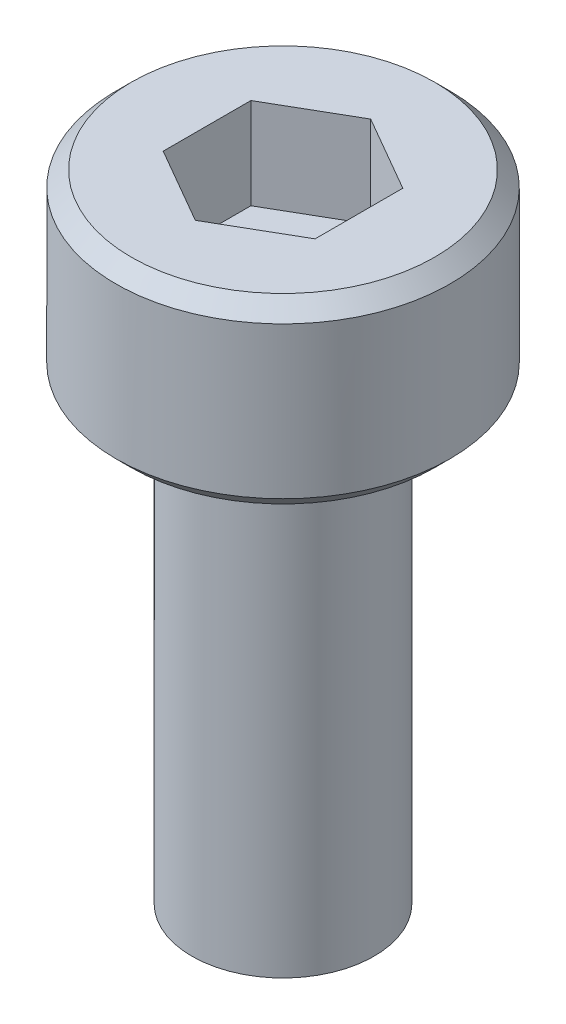
ISO-10303-21;
HEADER;
FILE_DESCRIPTION(('STEP AP214'),'2;1');
FILE_NAME('part.step','',(''),(''),'','','');
FILE_SCHEMA(('AUTOMOTIVE_DESIGN { 1 0 10303 214 1 1 1 1 }'));
ENDSEC;
DATA;
#1=APPLICATION_CONTEXT('core data for automotive mechanical design processes');
#2=APPLICATION_PROTOCOL_DEFINITION('international standard','automotive_design',2000,#1);
#3=PRODUCT_CONTEXT('',#1,'mechanical');
#4=PRODUCT('Part','Part','',(#3));
#5=PRODUCT_RELATED_PRODUCT_CATEGORY('part','',(#4));
#6=PRODUCT_DEFINITION_FORMATION('','',#4);
#7=PRODUCT_DEFINITION_CONTEXT('part definition',#1,'design');
#8=PRODUCT_DEFINITION('design','',#6,#7);
#9=PRODUCT_DEFINITION_SHAPE('','',#8);
#10=(LENGTH_UNIT() NAMED_UNIT(*) SI_UNIT(.MILLI.,.METRE.));
#11=(NAMED_UNIT(*) PLANE_ANGLE_UNIT() SI_UNIT($,.RADIAN.));
#12=(NAMED_UNIT(*) SI_UNIT($,.STERADIAN.) SOLID_ANGLE_UNIT());
#13=UNCERTAINTY_MEASURE_WITH_UNIT(LENGTH_MEASURE(1.E-05),#10,'distance_accuracy_value','');
#14=(GEOMETRIC_REPRESENTATION_CONTEXT(3) GLOBAL_UNCERTAINTY_ASSIGNED_CONTEXT((#13)) GLOBAL_UNIT_ASSIGNED_CONTEXT((#10,
#11,#12)) REPRESENTATION_CONTEXT('',''));
#15=CARTESIAN_POINT('',(0.,0.,0.));
#16=DIRECTION('',(0.,0.,1.));
#17=DIRECTION('',(1.,0.,0.));
#18=AXIS2_PLACEMENT_3D('',#15,#16,#17);
#19=CARTESIAN_POINT('',(-1.25,1.5,0.721687836487032));
#20=DIRECTION('',(0.,-1.,0.));
#21=DIRECTION('',(0.,0.,-1.));
#22=AXIS2_PLACEMENT_3D('',#19,#20,#21);
#23=PLANE('',#22);
#24=DIRECTION('',(0.866025403784439,0.,-0.5));
#25=VECTOR('',#24,1.);
#26=CARTESIAN_POINT('',(0.,1.5,1.44337567297406));
#27=LINE('',#26,#25);
#28=CARTESIAN_POINT('',(0.,1.5,1.44337567297406));
#29=VERTEX_POINT('',#28);
#30=CARTESIAN_POINT('',(1.25,1.5,0.721687836487032));
#31=VERTEX_POINT('',#30);
#32=EDGE_CURVE('E127',#29,#31,#27,.T.);
#33=ORIENTED_EDGE('',*,*,#32,.T.);
#34=DIRECTION('',(0.,0.,-1.));
#35=VECTOR('',#34,1.);
#36=CARTESIAN_POINT('',(1.25,1.5,0.721687836487032));
#37=LINE('',#36,#35);
#38=CARTESIAN_POINT('',(1.25,1.5,-0.721687836487032));
#39=VERTEX_POINT('',#38);
#40=EDGE_CURVE('E132',#31,#39,#37,.T.);
#41=ORIENTED_EDGE('',*,*,#40,.T.);
#42=DIRECTION('',(-0.866025403784439,0.,-0.5));
#43=VECTOR('',#42,1.);
#44=CARTESIAN_POINT('',(1.25,1.5,-0.721687836487032));
#45=LINE('',#44,#43);
#46=CARTESIAN_POINT('',(0.,1.5,-1.44337567297406));
#47=VERTEX_POINT('',#46);
#48=EDGE_CURVE('E136',#39,#47,#45,.T.);
#49=ORIENTED_EDGE('',*,*,#48,.T.);
#50=DIRECTION('',(-0.866025403784439,0.,0.5));
#51=VECTOR('',#50,1.);
#52=CARTESIAN_POINT('',(0.,1.5,-1.44337567297406));
#53=LINE('',#52,#51);
#54=CARTESIAN_POINT('',(-1.25,1.5,-0.721687836487032));
#55=VERTEX_POINT('',#54);
#56=EDGE_CURVE('E68',#47,#55,#53,.T.);
#57=ORIENTED_EDGE('',*,*,#56,.T.);
#58=DIRECTION('',(0.,0.,1.));
#59=VECTOR('',#58,1.);
#60=CARTESIAN_POINT('',(-1.25,1.5,-0.721687836487032));
#61=LINE('',#60,#59);
#62=CARTESIAN_POINT('',(-1.25,1.5,0.721687836487033));
#63=VERTEX_POINT('',#62);
#64=EDGE_CURVE('E70',#55,#63,#61,.T.);
#65=ORIENTED_EDGE('',*,*,#64,.T.);
#66=DIRECTION('',(0.866025403784439,0.,0.5));
#67=VECTOR('',#66,1.);
#68=CARTESIAN_POINT('',(-1.25,1.5,0.721687836487032));
#69=LINE('',#68,#67);
#70=EDGE_CURVE('E72',#63,#29,#69,.T.);
#71=ORIENTED_EDGE('',*,*,#70,.T.);
#72=EDGE_LOOP('',(#33,#41,#49,#57,#65,#71));
#73=FACE_BOUND('',#72,.T.);
#74=ADVANCED_FACE('F17',(#73),#23,.F.);
#75=CARTESIAN_POINT('',(-1.25,1.5,0.721687836487032));
#76=DIRECTION('',(-0.5,0.,0.866025403784439));
#77=DIRECTION('',(0.866025403784439,0.,0.5));
#78=AXIS2_PLACEMENT_3D('',#75,#76,#77);
#79=PLANE('',#78);
#80=DIRECTION('',(0.,1.,0.));
#81=VECTOR('',#80,1.);
#82=CARTESIAN_POINT('',(0.,1.5,1.44337567297406));
#83=LINE('',#82,#81);
#84=CARTESIAN_POINT('',(0.,3.,1.44337567297406));
#85=VERTEX_POINT('',#84);
#86=EDGE_CURVE('E83',#85,#29,#83,.F.);
#87=ORIENTED_EDGE('',*,*,#86,.T.);
#88=ORIENTED_EDGE('',*,*,#70,.F.);
#89=DIRECTION('',(0.,1.,0.));
#90=VECTOR('',#89,1.);
#91=CARTESIAN_POINT('',(-1.25,1.5,0.721687836487032));
#92=LINE('',#91,#90);
#93=CARTESIAN_POINT('',(-1.25,3.,0.721687836487032));
#94=VERTEX_POINT('',#93);
#95=EDGE_CURVE('E77',#63,#94,#92,.T.);
#96=ORIENTED_EDGE('',*,*,#95,.T.);
#97=DIRECTION('',(-0.866025403784439,0.,-0.5));
#98=VECTOR('',#97,1.);
#99=CARTESIAN_POINT('',(0.,3.,1.44337567297406));
#100=LINE('',#99,#98);
#101=EDGE_CURVE('E124',#85,#94,#100,.T.);
#102=ORIENTED_EDGE('',*,*,#101,.F.);
#103=EDGE_LOOP('',(#87,#88,#96,#102));
#104=FACE_BOUND('',#103,.T.);
#105=ADVANCED_FACE('F80',(#104),#79,.F.);
#106=CARTESIAN_POINT('',(-1.25,1.5,-0.721687836487032));
#107=DIRECTION('',(-1.,0.,0.));
#108=DIRECTION('',(0.,0.,1.));
#109=AXIS2_PLACEMENT_3D('',#106,#107,#108);
#110=PLANE('',#109);
#111=ORIENTED_EDGE('',*,*,#95,.F.);
#112=ORIENTED_EDGE('',*,*,#64,.F.);
#113=DIRECTION('',(0.,1.,0.));
#114=VECTOR('',#113,1.);
#115=CARTESIAN_POINT('',(-1.25,1.5,-0.721687836487032));
#116=LINE('',#115,#114);
#117=CARTESIAN_POINT('',(-1.25,3.,-0.721687836487032));
#118=VERTEX_POINT('',#117);
#119=EDGE_CURVE('E91',#55,#118,#116,.T.);
#120=ORIENTED_EDGE('',*,*,#119,.T.);
#121=DIRECTION('',(0.,0.,1.));
#122=VECTOR('',#121,1.);
#123=CARTESIAN_POINT('',(-1.25,3.,0.));
#124=LINE('',#123,#122);
#125=EDGE_CURVE('E88',#94,#118,#124,.F.);
#126=ORIENTED_EDGE('',*,*,#125,.F.);
#127=EDGE_LOOP('',(#111,#112,#120,#126));
#128=FACE_BOUND('',#127,.T.);
#129=ADVANCED_FACE('F86',(#128),#110,.F.);
#130=CARTESIAN_POINT('',(0.,1.5,-1.44337567297406));
#131=DIRECTION('',(-0.5,0.,-0.866025403784439));
#132=DIRECTION('',(-0.866025403784439,0.,0.5));
#133=AXIS2_PLACEMENT_3D('',#130,#131,#132);
#134=PLANE('',#133);
#135=ORIENTED_EDGE('',*,*,#119,.F.);
#136=ORIENTED_EDGE('',*,*,#56,.F.);
#137=DIRECTION('',(0.,1.,0.));
#138=VECTOR('',#137,1.);
#139=CARTESIAN_POINT('',(0.,1.5,-1.44337567297406));
#140=LINE('',#139,#138);
#141=CARTESIAN_POINT('',(0.,3.,-1.44337567297406));
#142=VERTEX_POINT('',#141);
#143=EDGE_CURVE('E134',#47,#142,#140,.T.);
#144=ORIENTED_EDGE('',*,*,#143,.T.);
#145=DIRECTION('',(0.866025403784439,0.,-0.5));
#146=VECTOR('',#145,1.);
#147=CARTESIAN_POINT('',(-1.25,3.,-0.721687836487032));
#148=LINE('',#147,#146);
#149=EDGE_CURVE('E120',#118,#142,#148,.T.);
#150=ORIENTED_EDGE('',*,*,#149,.F.);
#151=EDGE_LOOP('',(#135,#136,#144,#150));
#152=FACE_BOUND('',#151,.T.);
#153=ADVANCED_FACE('F139',(#152),#134,.F.);
#154=CARTESIAN_POINT('',(1.25,1.5,-0.721687836487032));
#155=DIRECTION('',(0.5,0.,-0.866025403784439));
#156=DIRECTION('',(-0.866025403784439,0.,-0.5));
#157=AXIS2_PLACEMENT_3D('',#154,#155,#156);
#158=PLANE('',#157);
#159=ORIENTED_EDGE('',*,*,#143,.F.);
#160=ORIENTED_EDGE('',*,*,#48,.F.);
#161=DIRECTION('',(0.,1.,0.));
#162=VECTOR('',#161,1.);
#163=CARTESIAN_POINT('',(1.25,1.5,-0.721687836487032));
#164=LINE('',#163,#162);
#165=CARTESIAN_POINT('',(1.25,3.,-0.721687836487032));
#166=VERTEX_POINT('',#165);
#167=EDGE_CURVE('E130',#39,#166,#164,.T.);
#168=ORIENTED_EDGE('',*,*,#167,.T.);
#169=DIRECTION('',(0.866025403784438,0.,0.5));
#170=VECTOR('',#169,1.);
#171=CARTESIAN_POINT('',(0.,3.,-1.44337567297406));
#172=LINE('',#171,#170);
#173=EDGE_CURVE('E117',#142,#166,#172,.T.);
#174=ORIENTED_EDGE('',*,*,#173,.F.);
#175=EDGE_LOOP('',(#159,#160,#168,#174));
#176=FACE_BOUND('',#175,.T.);
#177=ADVANCED_FACE('F151',(#176),#158,.F.);
#178=CARTESIAN_POINT('',(1.25,1.5,0.721687836487032));
#179=DIRECTION('',(1.,0.,0.));
#180=DIRECTION('',(0.,0.,-1.));
#181=AXIS2_PLACEMENT_3D('',#178,#179,#180);
#182=PLANE('',#181);
#183=ORIENTED_EDGE('',*,*,#167,.F.);
#184=ORIENTED_EDGE('',*,*,#40,.F.);
#185=DIRECTION('',(0.,1.,0.));
#186=VECTOR('',#185,1.);
#187=CARTESIAN_POINT('',(1.25,1.5,0.721687836487032));
#188=LINE('',#187,#186);
#189=CARTESIAN_POINT('',(1.25,3.,0.721687836487032));
#190=VERTEX_POINT('',#189);
#191=EDGE_CURVE('E35',#31,#190,#188,.T.);
#192=ORIENTED_EDGE('',*,*,#191,.T.);
#193=DIRECTION('',(0.,0.,1.));
#194=VECTOR('',#193,1.);
#195=CARTESIAN_POINT('',(1.25,3.,0.));
#196=LINE('',#195,#194);
#197=EDGE_CURVE('E114',#166,#190,#196,.T.);
#198=ORIENTED_EDGE('',*,*,#197,.F.);
#199=EDGE_LOOP('',(#183,#184,#192,#198));
#200=FACE_BOUND('',#199,.T.);
#201=ADVANCED_FACE('F149',(#200),#182,.F.);
#202=CARTESIAN_POINT('',(0.,1.5,1.44337567297406));
#203=DIRECTION('',(0.5,0.,0.866025403784439));
#204=DIRECTION('',(0.866025403784439,0.,-0.5));
#205=AXIS2_PLACEMENT_3D('',#202,#203,#204);
#206=PLANE('',#205);
#207=ORIENTED_EDGE('',*,*,#191,.F.);
#208=ORIENTED_EDGE('',*,*,#32,.F.);
#209=ORIENTED_EDGE('',*,*,#86,.F.);
#210=DIRECTION('',(-0.866025403784439,0.,0.5));
#211=VECTOR('',#210,1.);
#212=CARTESIAN_POINT('',(1.25,3.,0.721687836487032));
#213=LINE('',#212,#211);
#214=EDGE_CURVE('E111',#190,#85,#213,.T.);
#215=ORIENTED_EDGE('',*,*,#214,.F.);
#216=EDGE_LOOP('',(#207,#208,#209,#215));
#217=FACE_BOUND('',#216,.T.);
#218=ADVANCED_FACE('F146',(#217),#206,.F.);
#219=CARTESIAN_POINT('',(0.,3.,0.));
#220=DIRECTION('',(0.,1.,0.));
#221=DIRECTION('',(0.,0.,1.));
#222=AXIS2_PLACEMENT_3D('',#219,#220,#221);
#223=PLANE('',#222);
#224=ORIENTED_EDGE('',*,*,#197,.T.);
#225=ORIENTED_EDGE('',*,*,#214,.T.);
#226=ORIENTED_EDGE('',*,*,#101,.T.);
#227=ORIENTED_EDGE('',*,*,#125,.T.);
#228=ORIENTED_EDGE('',*,*,#149,.T.);
#229=ORIENTED_EDGE('',*,*,#173,.T.);
#230=EDGE_LOOP('',(#224,#225,#226,#227,#228,#229));
#231=FACE_BOUND('',#230,.T.);
#232=CARTESIAN_POINT('',(0.,3.00000000004275,0.));
#233=DIRECTION('',(0.,-1.,0.));
#234=DIRECTION('',(0.,0.,-1.));
#235=AXIS2_PLACEMENT_3D('',#232,#233,#234);
#236=CIRCLE('',#235,2.49600000000783);
#237=CARTESIAN_POINT('',(0.,3.00000000004275,-2.49600000000783));
#238=VERTEX_POINT('',#237);
#239=EDGE_CURVE('E20',#238,#238,#236,.T.);
#240=ORIENTED_EDGE('',*,*,#239,.F.);
#241=EDGE_LOOP('',(#240));
#242=FACE_BOUND('',#241,.T.);
#243=ADVANCED_FACE('F143',(#231,#242),#223,.T.);
#244=CARTESIAN_POINT('',(0.,2.7460000001156,0.));
#245=DIRECTION('',(0.,-1.,0.));
#246=DIRECTION('',(0.,0.,-1.));
#247=AXIS2_PLACEMENT_3D('',#244,#245,#246);
#248=CONICAL_SURFACE('',#247,2.74999999993497,0.785398163397448);
#249=ORIENTED_EDGE('',*,*,#239,.T.);
#250=EDGE_LOOP('',(#249));
#251=FACE_BOUND('',#250,.T.);
#252=CARTESIAN_POINT('',(0.,2.746,0.));
#253=DIRECTION('',(0.,-1.,0.));
#254=DIRECTION('',(0.,0.,-1.));
#255=AXIS2_PLACEMENT_3D('',#252,#253,#254);
#256=CIRCLE('',#255,2.75);
#257=CARTESIAN_POINT('',(0.,2.746,-2.75));
#258=VERTEX_POINT('',#257);
#259=EDGE_CURVE('E103',#258,#258,#256,.T.);
#260=ORIENTED_EDGE('',*,*,#259,.F.);
#261=EDGE_LOOP('',(#260));
#262=FACE_BOUND('',#261,.T.);
#263=ADVANCED_FACE('F188',(#251,#262),#248,.T.);
#264=CARTESIAN_POINT('',(0.,3.,0.));
#265=DIRECTION('',(0.,-1.,0.));
#266=DIRECTION('',(0.,0.,-1.));
#267=AXIS2_PLACEMENT_3D('',#264,#265,#266);
#268=CYLINDRICAL_SURFACE('',#267,2.75);
#269=ORIENTED_EDGE('',*,*,#259,.T.);
#270=EDGE_LOOP('',(#269));
#271=FACE_BOUND('',#270,.T.);
#272=CARTESIAN_POINT('',(0.,0.253999999983989,0.));
#273=DIRECTION('',(0.,1.,0.));
#274=DIRECTION('',(0.,0.,1.));
#275=AXIS2_PLACEMENT_3D('',#272,#273,#274);
#276=CIRCLE('',#275,2.74999999999181);
#277=CARTESIAN_POINT('',(0.,0.253999999983989,2.74999999999181));
#278=VERTEX_POINT('',#277);
#279=EDGE_CURVE('E99',#278,#278,#276,.F.);
#280=ORIENTED_EDGE('',*,*,#279,.F.);
#281=EDGE_LOOP('',(#280));
#282=FACE_BOUND('',#281,.T.);
#283=ADVANCED_FACE('F184',(#271,#282),#268,.T.);
#284=CARTESIAN_POINT('',(0.,-8.,0.));
#285=DIRECTION('',(0.,1.,0.));
#286=DIRECTION('',(0.,0.,1.));
#287=AXIS2_PLACEMENT_3D('',#284,#285,#286);
#288=PLANE('',#287);
#289=CARTESIAN_POINT('',(0.,-7.99999999998136,0.));
#290=DIRECTION('',(0.,1.,0.));
#291=DIRECTION('',(-1.,0.,0.));
#292=AXIS2_PLACEMENT_3D('',#289,#290,#291);
#293=CIRCLE('',#292,0.730379999993147);
#294=CARTESIAN_POINT('',(-0.730379999993147,-7.99999999998136,0.));
#295=VERTEX_POINT('',#294);
#296=EDGE_CURVE('E97',#295,#295,#293,.T.);
#297=ORIENTED_EDGE('',*,*,#296,.F.);
#298=EDGE_LOOP('',(#297));
#299=FACE_BOUND('',#298,.T.);
#300=ADVANCED_FACE('F180',(#299),#288,.F.);
#301=CARTESIAN_POINT('',(0.,0.254000000040833,0.));
#302=DIRECTION('',(0.,1.,0.));
#303=DIRECTION('',(0.,0.,1.));
#304=AXIS2_PLACEMENT_3D('',#301,#302,#303);
#305=CONICAL_SURFACE('',#304,2.7500000001055,0.785398163397448);
#306=CARTESIAN_POINT('',(0.,0.,0.));
#307=DIRECTION('',(0.,1.,0.));
#308=DIRECTION('',(0.,0.,1.));
#309=AXIS2_PLACEMENT_3D('',#306,#307,#308);
#310=CIRCLE('',#309,2.49600000006467);
#311=CARTESIAN_POINT('',(0.,0.,2.49600000006467));
#312=VERTEX_POINT('',#311);
#313=EDGE_CURVE('E95',#312,#312,#310,.T.);
#314=ORIENTED_EDGE('',*,*,#313,.T.);
#315=EDGE_LOOP('',(#314));
#316=FACE_BOUND('',#315,.T.);
#317=ORIENTED_EDGE('',*,*,#279,.T.);
#318=EDGE_LOOP('',(#317));
#319=FACE_BOUND('',#318,.T.);
#320=ADVANCED_FACE('F176',(#316,#319),#305,.T.);
#321=CARTESIAN_POINT('',(0.,-7.46151999993572,0.));
#322=DIRECTION('',(0.,1.,0.));
#323=DIRECTION('',(-1.,0.,0.));
#324=AXIS2_PLACEMENT_3D('',#321,#322,#323);
#325=CONICAL_SURFACE('',#324,1.50000000002137,0.960291895387899);
#326=CARTESIAN_POINT('',(0.,-7.46152,0.));
#327=DIRECTION('',(0.,1.,0.));
#328=DIRECTION('',(0.,0.,1.));
#329=AXIS2_PLACEMENT_3D('',#326,#327,#328);
#330=CIRCLE('',#329,1.5);
#331=CARTESIAN_POINT('',(0.,-7.46152,1.5));
#332=VERTEX_POINT('',#331);
#333=EDGE_CURVE('E26',#332,#332,#330,.T.);
#334=ORIENTED_EDGE('',*,*,#333,.F.);
#335=EDGE_LOOP('',(#334));
#336=FACE_BOUND('',#335,.T.);
#337=ORIENTED_EDGE('',*,*,#296,.T.);
#338=EDGE_LOOP('',(#337));
#339=FACE_BOUND('',#338,.T.);
#340=ADVANCED_FACE('F169',(#336,#339),#325,.T.);
#341=CARTESIAN_POINT('',(0.,0.,0.));
#342=DIRECTION('',(0.,1.,0.));
#343=DIRECTION('',(0.,0.,1.));
#344=AXIS2_PLACEMENT_3D('',#341,#342,#343);
#345=PLANE('',#344);
#346=CARTESIAN_POINT('',(0.,0.,0.));
#347=DIRECTION('',(0.,1.,0.));
#348=DIRECTION('',(0.,0.,1.));
#349=AXIS2_PLACEMENT_3D('',#346,#347,#348);
#350=CIRCLE('',#349,1.5);
#351=CARTESIAN_POINT('',(0.,0.,1.5));
#352=VERTEX_POINT('',#351);
#353=EDGE_CURVE('E11',#352,#352,#350,.F.);
#354=ORIENTED_EDGE('',*,*,#353,.F.);
#355=EDGE_LOOP('',(#354));
#356=FACE_BOUND('',#355,.T.);
#357=ORIENTED_EDGE('',*,*,#313,.F.);
#358=EDGE_LOOP('',(#357));
#359=FACE_BOUND('',#358,.T.);
#360=ADVANCED_FACE('F163',(#356,#359),#345,.F.);
#361=CARTESIAN_POINT('',(0.,-8.,0.));
#362=DIRECTION('',(0.,1.,0.));
#363=DIRECTION('',(0.,0.,1.));
#364=AXIS2_PLACEMENT_3D('',#361,#362,#363);
#365=CYLINDRICAL_SURFACE('',#364,1.5);
#366=ORIENTED_EDGE('',*,*,#353,.T.);
#367=EDGE_LOOP('',(#366));
#368=FACE_BOUND('',#367,.T.);
#369=ORIENTED_EDGE('',*,*,#333,.T.);
#370=EDGE_LOOP('',(#369));
#371=FACE_BOUND('',#370,.T.);
#372=ADVANCED_FACE('F161',(#368,#371),#365,.T.);
#373=CLOSED_SHELL('',(#74,#105,#129,#153,#177,#201,#218,#243,#263,#283,#300,#320,#340,#360,#372));
#374=MANIFOLD_SOLID_BREP('B1',#373);
#375=ADVANCED_BREP_SHAPE_REPRESENTATION('',(#18,#374),#14);
#376=SHAPE_DEFINITION_REPRESENTATION(#9,#375);
ENDSEC;
END-ISO-10303-21;
